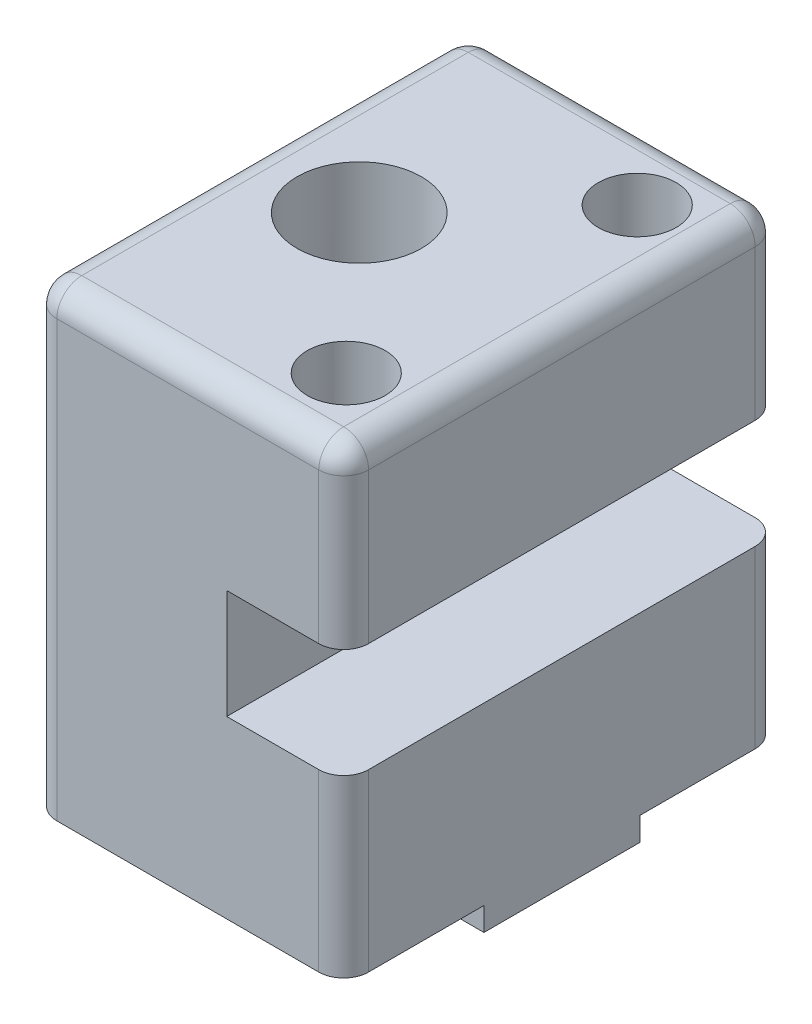
ISO-10303-21;
HEADER;
FILE_DESCRIPTION(('STEP AP214'),'2;1');
FILE_NAME('part.step','',(''),(''),'','','');
FILE_SCHEMA(('AUTOMOTIVE_DESIGN { 1 0 10303 214 1 1 1 1 }'));
ENDSEC;
DATA;
#1=APPLICATION_CONTEXT('core data for automotive mechanical design processes');
#2=APPLICATION_PROTOCOL_DEFINITION('international standard','automotive_design',2000,#1);
#3=PRODUCT_CONTEXT('',#1,'mechanical');
#4=PRODUCT('Part','Part','',(#3));
#5=PRODUCT_RELATED_PRODUCT_CATEGORY('part','',(#4));
#6=PRODUCT_DEFINITION_FORMATION('','',#4);
#7=PRODUCT_DEFINITION_CONTEXT('part definition',#1,'design');
#8=PRODUCT_DEFINITION('design','',#6,#7);
#9=PRODUCT_DEFINITION_SHAPE('','',#8);
#10=(LENGTH_UNIT() NAMED_UNIT(*) SI_UNIT(.MILLI.,.METRE.));
#11=(NAMED_UNIT(*) PLANE_ANGLE_UNIT() SI_UNIT($,.RADIAN.));
#12=(NAMED_UNIT(*) SI_UNIT($,.STERADIAN.) SOLID_ANGLE_UNIT());
#13=UNCERTAINTY_MEASURE_WITH_UNIT(LENGTH_MEASURE(1.E-05),#10,'distance_accuracy_value','');
#14=(GEOMETRIC_REPRESENTATION_CONTEXT(3) GLOBAL_UNCERTAINTY_ASSIGNED_CONTEXT((#13)) GLOBAL_UNIT_ASSIGNED_CONTEXT((#10,
#11,#12)) REPRESENTATION_CONTEXT('',''));
#15=CARTESIAN_POINT('',(0.,0.,0.));
#16=DIRECTION('',(0.,0.,1.));
#17=DIRECTION('',(1.,0.,0.));
#18=AXIS2_PLACEMENT_3D('',#15,#16,#17);
#19=CARTESIAN_POINT('',(15.875,-23.415625,22.225));
#20=DIRECTION('',(0.,1.,0.));
#21=DIRECTION('',(-1.,0.,0.));
#22=AXIS2_PLACEMENT_3D('',#19,#20,#21);
#23=PLANE('',#22);
#24=DIRECTION('',(0.,0.,-1.));
#25=VECTOR('',#24,1.);
#26=CARTESIAN_POINT('',(-15.875,-23.415625,22.225));
#27=LINE('',#26,#25);
#28=CARTESIAN_POINT('',(-15.875,-23.415625,-7.9375));
#29=VERTEX_POINT('',#28);
#30=CARTESIAN_POINT('',(-15.875,-23.415625,-19.685));
#31=VERTEX_POINT('',#30);
#32=EDGE_CURVE('E183',#29,#31,#27,.T.);
#33=ORIENTED_EDGE('',*,*,#32,.T.);
#34=CARTESIAN_POINT('',(-13.335,-23.415625,-19.685));
#35=DIRECTION('',(0.,1.,0.));
#36=DIRECTION('',(-1.,0.,0.));
#37=AXIS2_PLACEMENT_3D('',#34,#35,#36);
#38=CIRCLE('',#37,2.54);
#39=CARTESIAN_POINT('',(-13.335,-23.415625,-22.225));
#40=VERTEX_POINT('',#39);
#41=EDGE_CURVE('E294',#31,#40,#38,.F.);
#42=ORIENTED_EDGE('',*,*,#41,.T.);
#43=DIRECTION('',(1.,0.,0.));
#44=VECTOR('',#43,1.);
#45=CARTESIAN_POINT('',(15.875,-23.415625,-22.225));
#46=LINE('',#45,#44);
#47=CARTESIAN_POINT('',(13.335,-23.415625,-22.225));
#48=VERTEX_POINT('',#47);
#49=EDGE_CURVE('E216',#40,#48,#46,.T.);
#50=ORIENTED_EDGE('',*,*,#49,.T.);
#51=CARTESIAN_POINT('',(13.335,-23.415625,-19.685));
#52=DIRECTION('',(0.,1.,0.));
#53=DIRECTION('',(-1.,0.,0.));
#54=AXIS2_PLACEMENT_3D('',#51,#52,#53);
#55=CIRCLE('',#54,2.54);
#56=CARTESIAN_POINT('',(15.875,-23.415625,-19.685));
#57=VERTEX_POINT('',#56);
#58=EDGE_CURVE('E292',#48,#57,#55,.F.);
#59=ORIENTED_EDGE('',*,*,#58,.T.);
#60=DIRECTION('',(0.,0.,-1.));
#61=VECTOR('',#60,1.);
#62=CARTESIAN_POINT('',(15.875,-23.415625,22.225));
#63=LINE('',#62,#61);
#64=CARTESIAN_POINT('',(15.875,-23.415625,-7.9375));
#65=VERTEX_POINT('',#64);
#66=EDGE_CURVE('E251',#65,#57,#63,.T.);
#67=ORIENTED_EDGE('',*,*,#66,.F.);
#68=DIRECTION('',(1.,0.,0.));
#69=VECTOR('',#68,1.);
#70=CARTESIAN_POINT('',(-15.875,-23.415625,-7.9375));
#71=LINE('',#70,#69);
#72=EDGE_CURVE('E214',#29,#65,#71,.T.);
#73=ORIENTED_EDGE('',*,*,#72,.F.);
#74=EDGE_LOOP('',(#33,#42,#50,#59,#67,#73));
#75=FACE_BOUND('',#74,.T.);
#76=ADVANCED_FACE('F33',(#75),#23,.F.);
#77=CARTESIAN_POINT('',(-15.875,23.415625,22.225));
#78=DIRECTION('',(1.,0.,0.));
#79=DIRECTION('',(0.,1.,0.));
#80=AXIS2_PLACEMENT_3D('',#77,#78,#79);
#81=PLANE('',#80);
#82=DIRECTION('',(0.,0.,-1.));
#83=VECTOR('',#82,1.);
#84=CARTESIAN_POINT('',(-15.875,20.875625,22.225));
#85=LINE('',#84,#83);
#86=CARTESIAN_POINT('',(-15.875,20.875625,19.685));
#87=VERTEX_POINT('',#86);
#88=CARTESIAN_POINT('',(-15.875,20.875625,-19.685));
#89=VERTEX_POINT('',#88);
#90=EDGE_CURVE('E280',#87,#89,#85,.T.);
#91=ORIENTED_EDGE('',*,*,#90,.T.);
#92=DIRECTION('',(0.,-1.,0.));
#93=VECTOR('',#92,1.);
#94=CARTESIAN_POINT('',(-15.875,-23.415625,-19.685));
#95=LINE('',#94,#93);
#96=EDGE_CURVE('E282',#89,#31,#95,.T.);
#97=ORIENTED_EDGE('',*,*,#96,.T.);
#98=ORIENTED_EDGE('',*,*,#32,.F.);
#99=DIRECTION('',(0.,1.,0.));
#100=VECTOR('',#99,1.);
#101=CARTESIAN_POINT('',(-15.875,-23.415625,-7.9375));
#102=LINE('',#101,#100);
#103=CARTESIAN_POINT('',(-15.875,-25.796875,-7.9375));
#104=VERTEX_POINT('',#103);
#105=EDGE_CURVE('E193',#104,#29,#102,.T.);
#106=ORIENTED_EDGE('',*,*,#105,.F.);
#107=DIRECTION('',(0.,0.,-1.));
#108=VECTOR('',#107,1.);
#109=CARTESIAN_POINT('',(-15.875,-25.796875,7.9375));
#110=LINE('',#109,#108);
#111=CARTESIAN_POINT('',(-15.875,-25.796875,7.9375));
#112=VERTEX_POINT('',#111);
#113=EDGE_CURVE('E199',#112,#104,#110,.T.);
#114=ORIENTED_EDGE('',*,*,#113,.F.);
#115=DIRECTION('',(0.,-1.,0.));
#116=VECTOR('',#115,1.);
#117=CARTESIAN_POINT('',(-15.875,-23.415625,7.9375));
#118=LINE('',#117,#116);
#119=CARTESIAN_POINT('',(-15.875,-23.415625,7.9375));
#120=VERTEX_POINT('',#119);
#121=EDGE_CURVE('E189',#120,#112,#118,.T.);
#122=ORIENTED_EDGE('',*,*,#121,.F.);
#123=CARTESIAN_POINT('',(-15.875,-23.415625,19.685));
#124=VERTEX_POINT('',#123);
#125=EDGE_CURVE('E173',#124,#120,#27,.T.);
#126=ORIENTED_EDGE('',*,*,#125,.F.);
#127=DIRECTION('',(0.,-1.,0.));
#128=VECTOR('',#127,1.);
#129=CARTESIAN_POINT('',(-15.875,23.415625,19.685));
#130=LINE('',#129,#128);
#131=EDGE_CURVE('E278',#124,#87,#130,.F.);
#132=ORIENTED_EDGE('',*,*,#131,.T.);
#133=EDGE_LOOP('',(#91,#97,#98,#106,#114,#122,#126,#132));
#134=FACE_BOUND('',#133,.T.);
#135=ADVANCED_FACE('F196',(#134),#81,.F.);
#136=CARTESIAN_POINT('',(15.875,-23.415625,19.685));
#137=VERTEX_POINT('',#136);
#138=CARTESIAN_POINT('',(15.875,-23.415625,7.9375));
#139=VERTEX_POINT('',#138);
#140=EDGE_CURVE('E252',#137,#139,#63,.T.);
#141=ORIENTED_EDGE('',*,*,#140,.F.);
#142=CARTESIAN_POINT('',(13.335,-23.415625,19.685));
#143=DIRECTION('',(0.,1.,0.));
#144=DIRECTION('',(-1.,0.,0.));
#145=AXIS2_PLACEMENT_3D('',#142,#143,#144);
#146=CIRCLE('',#145,2.54);
#147=CARTESIAN_POINT('',(13.335,-23.415625,22.225));
#148=VERTEX_POINT('',#147);
#149=EDGE_CURVE('E11',#137,#148,#146,.F.);
#150=ORIENTED_EDGE('',*,*,#149,.T.);
#151=DIRECTION('',(1.,0.,0.));
#152=VECTOR('',#151,1.);
#153=CARTESIAN_POINT('',(15.875,-23.415625,22.225));
#154=LINE('',#153,#152);
#155=CARTESIAN_POINT('',(-13.335,-23.415625,22.225));
#156=VERTEX_POINT('',#155);
#157=EDGE_CURVE('E220',#156,#148,#154,.T.);
#158=ORIENTED_EDGE('',*,*,#157,.F.);
#159=CARTESIAN_POINT('',(-13.335,-23.415625,19.685));
#160=DIRECTION('',(0.,1.,0.));
#161=DIRECTION('',(-1.,0.,0.));
#162=AXIS2_PLACEMENT_3D('',#159,#160,#161);
#163=CIRCLE('',#162,2.54);
#164=EDGE_CURVE('E42',#156,#124,#163,.F.);
#165=ORIENTED_EDGE('',*,*,#164,.T.);
#166=ORIENTED_EDGE('',*,*,#125,.T.);
#167=DIRECTION('',(1.,0.,0.));
#168=VECTOR('',#167,1.);
#169=CARTESIAN_POINT('',(-15.875,-23.415625,7.9375));
#170=LINE('',#169,#168);
#171=EDGE_CURVE('E176',#120,#139,#170,.T.);
#172=ORIENTED_EDGE('',*,*,#171,.T.);
#173=EDGE_LOOP('',(#141,#150,#158,#165,#166,#172));
#174=FACE_BOUND('',#173,.T.);
#175=ADVANCED_FACE('F175',(#174),#23,.F.);
#176=CARTESIAN_POINT('',(15.875,-5.55624999999999,22.225));
#177=DIRECTION('',(-1.,0.,0.));
#178=DIRECTION('',(0.,0.,1.));
#179=AXIS2_PLACEMENT_3D('',#176,#177,#178);
#180=PLANE('',#179);
#181=ORIENTED_EDGE('',*,*,#66,.T.);
#182=DIRECTION('',(0.,1.,0.));
#183=VECTOR('',#182,1.);
#184=CARTESIAN_POINT('',(15.875,-5.55624999999999,-19.685));
#185=LINE('',#184,#183);
#186=CARTESIAN_POINT('',(15.875,-5.55624999999999,-19.685));
#187=VERTEX_POINT('',#186);
#188=EDGE_CURVE('E301',#57,#187,#185,.T.);
#189=ORIENTED_EDGE('',*,*,#188,.T.);
#190=DIRECTION('',(0.,0.,-1.));
#191=VECTOR('',#190,1.);
#192=CARTESIAN_POINT('',(15.875,-5.55624999999999,22.225));
#193=LINE('',#192,#191);
#194=CARTESIAN_POINT('',(15.875,-5.55624999999999,19.685));
#195=VERTEX_POINT('',#194);
#196=EDGE_CURVE('E248',#195,#187,#193,.T.);
#197=ORIENTED_EDGE('',*,*,#196,.F.);
#198=DIRECTION('',(0.,1.,0.));
#199=VECTOR('',#198,1.);
#200=CARTESIAN_POINT('',(15.875,-5.55624999999999,19.685));
#201=LINE('',#200,#199);
#202=EDGE_CURVE('E50',#195,#137,#201,.F.);
#203=ORIENTED_EDGE('',*,*,#202,.T.);
#204=ORIENTED_EDGE('',*,*,#140,.T.);
#205=DIRECTION('',(0.,-1.,0.));
#206=VECTOR('',#205,1.);
#207=CARTESIAN_POINT('',(15.875,-23.415625,7.9375));
#208=LINE('',#207,#206);
#209=CARTESIAN_POINT('',(15.875,-25.796875,7.9375));
#210=VERTEX_POINT('',#209);
#211=EDGE_CURVE('E191',#139,#210,#208,.T.);
#212=ORIENTED_EDGE('',*,*,#211,.T.);
#213=DIRECTION('',(0.,0.,-1.));
#214=VECTOR('',#213,1.);
#215=CARTESIAN_POINT('',(15.875,-25.796875,7.9375));
#216=LINE('',#215,#214);
#217=CARTESIAN_POINT('',(15.875,-25.796875,-7.9375));
#218=VERTEX_POINT('',#217);
#219=EDGE_CURVE('E204',#210,#218,#216,.T.);
#220=ORIENTED_EDGE('',*,*,#219,.T.);
#221=DIRECTION('',(0.,1.,0.));
#222=VECTOR('',#221,1.);
#223=CARTESIAN_POINT('',(15.875,-23.415625,-7.9375));
#224=LINE('',#223,#222);
#225=EDGE_CURVE('E200',#218,#65,#224,.T.);
#226=ORIENTED_EDGE('',*,*,#225,.T.);
#227=EDGE_LOOP('',(#181,#189,#197,#203,#204,#212,#220,#226));
#228=FACE_BOUND('',#227,.T.);
#229=ADVANCED_FACE('F427',(#228),#180,.F.);
#230=CARTESIAN_POINT('',(15.875,-5.55624999999999,22.225));
#231=DIRECTION('',(0.,-1.,0.));
#232=DIRECTION('',(1.,0.,0.));
#233=AXIS2_PLACEMENT_3D('',#230,#231,#232);
#234=PLANE('',#233);
#235=ORIENTED_EDGE('',*,*,#196,.T.);
#236=CARTESIAN_POINT('',(13.335,-5.55624999999999,-19.685));
#237=DIRECTION('',(0.,-1.,0.));
#238=DIRECTION('',(1.,0.,0.));
#239=AXIS2_PLACEMENT_3D('',#236,#237,#238);
#240=CIRCLE('',#239,2.54);
#241=CARTESIAN_POINT('',(13.335,-5.55624999999999,-22.225));
#242=VERTEX_POINT('',#241);
#243=EDGE_CURVE('E58',#187,#242,#240,.F.);
#244=ORIENTED_EDGE('',*,*,#243,.T.);
#245=DIRECTION('',(-1.,0.,0.));
#246=VECTOR('',#245,1.);
#247=CARTESIAN_POINT('',(15.875,-5.55624999999999,-22.225));
#248=LINE('',#247,#246);
#249=CARTESIAN_POINT('',(3.96875,-5.55625,-22.225));
#250=VERTEX_POINT('',#249);
#251=EDGE_CURVE('E234',#242,#250,#248,.T.);
#252=ORIENTED_EDGE('',*,*,#251,.T.);
#253=DIRECTION('',(0.,0.,-1.));
#254=VECTOR('',#253,1.);
#255=CARTESIAN_POINT('',(3.96875,-5.55625,22.225));
#256=LINE('',#255,#254);
#257=CARTESIAN_POINT('',(3.96875,-5.55625,22.225));
#258=VERTEX_POINT('',#257);
#259=EDGE_CURVE('E245',#258,#250,#256,.T.);
#260=ORIENTED_EDGE('',*,*,#259,.F.);
#261=DIRECTION('',(-1.,0.,0.));
#262=VECTOR('',#261,1.);
#263=CARTESIAN_POINT('',(15.875,-5.55624999999999,22.225));
#264=LINE('',#263,#262);
#265=CARTESIAN_POINT('',(13.335,-5.55624999999999,22.225));
#266=VERTEX_POINT('',#265);
#267=EDGE_CURVE('E223',#266,#258,#264,.T.);
#268=ORIENTED_EDGE('',*,*,#267,.F.);
#269=CARTESIAN_POINT('',(13.335,-5.55624999999999,19.685));
#270=DIRECTION('',(0.,-1.,0.));
#271=DIRECTION('',(1.,0.,0.));
#272=AXIS2_PLACEMENT_3D('',#269,#270,#271);
#273=CIRCLE('',#272,2.54);
#274=EDGE_CURVE('E303',#266,#195,#273,.F.);
#275=ORIENTED_EDGE('',*,*,#274,.T.);
#276=EDGE_LOOP('',(#235,#244,#252,#260,#268,#275));
#277=FACE_BOUND('',#276,.T.);
#278=ADVANCED_FACE('F431',(#277),#234,.F.);
#279=CARTESIAN_POINT('',(3.96874999999999,5.55625,22.225));
#280=DIRECTION('',(-1.,0.,0.));
#281=DIRECTION('',(0.,-1.,0.));
#282=AXIS2_PLACEMENT_3D('',#279,#280,#281);
#283=PLANE('',#282);
#284=DIRECTION('',(0.,1.,0.));
#285=VECTOR('',#284,1.);
#286=CARTESIAN_POINT('',(3.96874999999999,5.55625,-22.225));
#287=LINE('',#286,#285);
#288=CARTESIAN_POINT('',(3.96874999999999,5.55625,-22.225));
#289=VERTEX_POINT('',#288);
#290=EDGE_CURVE('E236',#250,#289,#287,.T.);
#291=ORIENTED_EDGE('',*,*,#290,.T.);
#292=DIRECTION('',(0.,0.,-1.));
#293=VECTOR('',#292,1.);
#294=CARTESIAN_POINT('',(3.96874999999999,5.55625,22.225));
#295=LINE('',#294,#293);
#296=CARTESIAN_POINT('',(3.96874999999999,5.55625,22.225));
#297=VERTEX_POINT('',#296);
#298=EDGE_CURVE('E242',#297,#289,#295,.T.);
#299=ORIENTED_EDGE('',*,*,#298,.F.);
#300=DIRECTION('',(0.,1.,0.));
#301=VECTOR('',#300,1.);
#302=CARTESIAN_POINT('',(3.96874999999999,5.55625,22.225));
#303=LINE('',#302,#301);
#304=EDGE_CURVE('E226',#258,#297,#303,.T.);
#305=ORIENTED_EDGE('',*,*,#304,.F.);
#306=ORIENTED_EDGE('',*,*,#259,.T.);
#307=EDGE_LOOP('',(#291,#299,#305,#306));
#308=FACE_BOUND('',#307,.T.);
#309=ADVANCED_FACE('F370',(#308),#283,.F.);
#310=CARTESIAN_POINT('',(15.875,5.55625,22.225));
#311=DIRECTION('',(0.,1.,0.));
#312=DIRECTION('',(0.,0.,1.));
#313=AXIS2_PLACEMENT_3D('',#310,#311,#312);
#314=PLANE('',#313);
#315=CARTESIAN_POINT('',(8.73125,5.55625,-14.8166666666667));
#316=DIRECTION('',(0.,1.,0.));
#317=DIRECTION('',(0.,0.,1.));
#318=AXIS2_PLACEMENT_3D('',#315,#316,#317);
#319=CIRCLE('',#318,3.96875);
#320=CARTESIAN_POINT('',(8.73125,5.55625,-10.8479166666667));
#321=VERTEX_POINT('',#320);
#322=EDGE_CURVE('E348',#321,#321,#319,.F.);
#323=ORIENTED_EDGE('',*,*,#322,.F.);
#324=EDGE_LOOP('',(#323));
#325=FACE_BOUND('',#324,.T.);
#326=CARTESIAN_POINT('',(8.73125,5.55625,14.8166666666667));
#327=DIRECTION('',(0.,1.,0.));
#328=DIRECTION('',(0.,0.,1.));
#329=AXIS2_PLACEMENT_3D('',#326,#327,#328);
#330=CIRCLE('',#329,3.96875);
#331=CARTESIAN_POINT('',(8.73125,5.55625,18.7854166666667));
#332=VERTEX_POINT('',#331);
#333=EDGE_CURVE('E340',#332,#332,#330,.F.);
#334=ORIENTED_EDGE('',*,*,#333,.F.);
#335=EDGE_LOOP('',(#334));
#336=FACE_BOUND('',#335,.T.);
#337=DIRECTION('',(1.,0.,0.));
#338=VECTOR('',#337,1.);
#339=CARTESIAN_POINT('',(15.875,5.55625,-22.225));
#340=LINE('',#339,#338);
#341=CARTESIAN_POINT('',(13.335,5.55625,-22.225));
#342=VERTEX_POINT('',#341);
#343=EDGE_CURVE('E224',#289,#342,#340,.T.);
#344=ORIENTED_EDGE('',*,*,#343,.T.);
#345=CARTESIAN_POINT('',(13.335,5.55625,-19.685));
#346=DIRECTION('',(0.,1.,0.));
#347=DIRECTION('',(0.,0.,1.));
#348=AXIS2_PLACEMENT_3D('',#345,#346,#347);
#349=CIRCLE('',#348,2.54);
#350=CARTESIAN_POINT('',(15.875,5.55625,-19.685));
#351=VERTEX_POINT('',#350);
#352=EDGE_CURVE('E298',#342,#351,#349,.F.);
#353=ORIENTED_EDGE('',*,*,#352,.T.);
#354=DIRECTION('',(0.,0.,-1.));
#355=VECTOR('',#354,1.);
#356=CARTESIAN_POINT('',(15.875,5.55625,22.225));
#357=LINE('',#356,#355);
#358=CARTESIAN_POINT('',(15.875,5.55625,19.685));
#359=VERTEX_POINT('',#358);
#360=EDGE_CURVE('E231',#359,#351,#357,.T.);
#361=ORIENTED_EDGE('',*,*,#360,.F.);
#362=CARTESIAN_POINT('',(13.335,5.55625,19.685));
#363=DIRECTION('',(0.,1.,0.));
#364=DIRECTION('',(0.,0.,1.));
#365=AXIS2_PLACEMENT_3D('',#362,#363,#364);
#366=CIRCLE('',#365,2.54);
#367=CARTESIAN_POINT('',(13.335,5.55625,22.225));
#368=VERTEX_POINT('',#367);
#369=EDGE_CURVE('E296',#359,#368,#366,.F.);
#370=ORIENTED_EDGE('',*,*,#369,.T.);
#371=DIRECTION('',(1.,0.,0.));
#372=VECTOR('',#371,1.);
#373=CARTESIAN_POINT('',(15.875,5.55625,22.225));
#374=LINE('',#373,#372);
#375=EDGE_CURVE('E228',#297,#368,#374,.T.);
#376=ORIENTED_EDGE('',*,*,#375,.F.);
#377=ORIENTED_EDGE('',*,*,#298,.T.);
#378=EDGE_LOOP('',(#344,#353,#361,#370,#376,#377));
#379=FACE_BOUND('',#378,.T.);
#380=ADVANCED_FACE('F366',(#325,#336,#379),#314,.F.);
#381=CARTESIAN_POINT('',(15.875,23.415625,22.225));
#382=DIRECTION('',(-1.,0.,0.));
#383=DIRECTION('',(0.,-1.,0.));
#384=AXIS2_PLACEMENT_3D('',#381,#382,#383);
#385=PLANE('',#384);
#386=ORIENTED_EDGE('',*,*,#360,.T.);
#387=DIRECTION('',(0.,1.,0.));
#388=VECTOR('',#387,1.);
#389=CARTESIAN_POINT('',(15.875,23.415625,-19.685));
#390=LINE('',#389,#388);
#391=CARTESIAN_POINT('',(15.875,20.875625,-19.685));
#392=VERTEX_POINT('',#391);
#393=EDGE_CURVE('E267',#351,#392,#390,.T.);
#394=ORIENTED_EDGE('',*,*,#393,.T.);
#395=DIRECTION('',(0.,0.,-1.));
#396=VECTOR('',#395,1.);
#397=CARTESIAN_POINT('',(15.875,20.875625,22.225));
#398=LINE('',#397,#396);
#399=CARTESIAN_POINT('',(15.875,20.875625,19.685));
#400=VERTEX_POINT('',#399);
#401=EDGE_CURVE('E264',#392,#400,#398,.F.);
#402=ORIENTED_EDGE('',*,*,#401,.T.);
#403=DIRECTION('',(0.,1.,0.));
#404=VECTOR('',#403,1.);
#405=CARTESIAN_POINT('',(15.875,23.415625,19.685));
#406=LINE('',#405,#404);
#407=EDGE_CURVE('E262',#400,#359,#406,.F.);
#408=ORIENTED_EDGE('',*,*,#407,.T.);
#409=EDGE_LOOP('',(#386,#394,#402,#408));
#410=FACE_BOUND('',#409,.T.);
#411=ADVANCED_FACE('F369',(#410),#385,.F.);
#412=CARTESIAN_POINT('',(15.875,23.415625,22.225));
#413=DIRECTION('',(0.,-1.,0.));
#414=DIRECTION('',(1.,0.,0.));
#415=AXIS2_PLACEMENT_3D('',#412,#413,#414);
#416=PLANE('',#415);
#417=DIRECTION('',(-1.,0.,0.));
#418=VECTOR('',#417,1.);
#419=CARTESIAN_POINT('',(15.875,23.415625,19.685));
#420=LINE('',#419,#418);
#421=CARTESIAN_POINT('',(-13.335,23.415625,19.685));
#422=VERTEX_POINT('',#421);
#423=CARTESIAN_POINT('',(13.335,23.415625,19.685));
#424=VERTEX_POINT('',#423);
#425=EDGE_CURVE('E257',#422,#424,#420,.F.);
#426=ORIENTED_EDGE('',*,*,#425,.T.);
#427=DIRECTION('',(0.,0.,-1.));
#428=VECTOR('',#427,1.);
#429=CARTESIAN_POINT('',(13.335,23.415625,22.225));
#430=LINE('',#429,#428);
#431=CARTESIAN_POINT('',(13.335,23.415625,-19.685));
#432=VERTEX_POINT('',#431);
#433=EDGE_CURVE('E259',#424,#432,#430,.T.);
#434=ORIENTED_EDGE('',*,*,#433,.T.);
#435=DIRECTION('',(-1.,0.,0.));
#436=VECTOR('',#435,1.);
#437=CARTESIAN_POINT('',(-15.875,23.415625,-19.685));
#438=LINE('',#437,#436);
#439=CARTESIAN_POINT('',(-13.335,23.415625,-19.685));
#440=VERTEX_POINT('',#439);
#441=EDGE_CURVE('E182',#432,#440,#438,.T.);
#442=ORIENTED_EDGE('',*,*,#441,.T.);
#443=DIRECTION('',(0.,0.,-1.));
#444=VECTOR('',#443,1.);
#445=CARTESIAN_POINT('',(-13.335,23.415625,22.225));
#446=LINE('',#445,#444);
#447=EDGE_CURVE('E255',#440,#422,#446,.F.);
#448=ORIENTED_EDGE('',*,*,#447,.T.);
#449=EDGE_LOOP('',(#426,#434,#442,#448));
#450=FACE_BOUND('',#449,.T.);
#451=CARTESIAN_POINT('',(8.73124999999999,23.415625,-14.8166666666667));
#452=DIRECTION('',(0.,1.,0.));
#453=DIRECTION('',(-1.,0.,0.));
#454=AXIS2_PLACEMENT_3D('',#451,#452,#453);
#455=CIRCLE('',#454,3.96875);
#456=CARTESIAN_POINT('',(4.76249999999999,23.415625,-14.8166666666667));
#457=VERTEX_POINT('',#456);
#458=EDGE_CURVE('E351',#457,#457,#455,.T.);
#459=ORIENTED_EDGE('',*,*,#458,.F.);
#460=EDGE_LOOP('',(#459));
#461=FACE_BOUND('',#460,.T.);
#462=CARTESIAN_POINT('',(8.73124999999999,23.415625,14.8166666666667));
#463=DIRECTION('',(0.,1.,0.));
#464=DIRECTION('',(1.,0.,0.));
#465=AXIS2_PLACEMENT_3D('',#462,#463,#464);
#466=CIRCLE('',#465,3.96875);
#467=CARTESIAN_POINT('',(12.7,23.415625,14.8166666666667));
#468=VERTEX_POINT('',#467);
#469=EDGE_CURVE('E343',#468,#468,#466,.T.);
#470=ORIENTED_EDGE('',*,*,#469,.F.);
#471=EDGE_LOOP('',(#470));
#472=FACE_BOUND('',#471,.T.);
#473=CARTESIAN_POINT('',(-4.76250000000001,23.415625,0.));
#474=DIRECTION('',(0.,-1.,0.));
#475=DIRECTION('',(1.,0.,0.));
#476=AXIS2_PLACEMENT_3D('',#473,#474,#475);
#477=CIRCLE('',#476,6.33095);
#478=CARTESIAN_POINT('',(1.56845,23.415625,0.));
#479=VERTEX_POINT('',#478);
#480=EDGE_CURVE('E207',#479,#479,#477,.T.);
#481=ORIENTED_EDGE('',*,*,#480,.T.);
#482=EDGE_LOOP('',(#481));
#483=FACE_BOUND('',#482,.T.);
#484=ADVANCED_FACE('F444',(#450,#461,#472,#483),#416,.F.);
#485=CARTESIAN_POINT('',(0.,0.,22.225));
#486=DIRECTION('',(0.,0.,-1.));
#487=DIRECTION('',(-1.,0.,0.));
#488=AXIS2_PLACEMENT_3D('',#485,#486,#487);
#489=PLANE('',#488);
#490=ORIENTED_EDGE('',*,*,#157,.T.);
#491=DIRECTION('',(0.,1.,0.));
#492=VECTOR('',#491,1.);
#493=CARTESIAN_POINT('',(13.335,0.,22.225));
#494=LINE('',#493,#492);
#495=EDGE_CURVE('E275',#148,#266,#494,.T.);
#496=ORIENTED_EDGE('',*,*,#495,.T.);
#497=ORIENTED_EDGE('',*,*,#267,.T.);
#498=ORIENTED_EDGE('',*,*,#304,.T.);
#499=ORIENTED_EDGE('',*,*,#375,.T.);
#500=DIRECTION('',(0.,1.,0.));
#501=VECTOR('',#500,1.);
#502=CARTESIAN_POINT('',(13.335,0.,22.225));
#503=LINE('',#502,#501);
#504=CARTESIAN_POINT('',(13.335,20.875625,22.225));
#505=VERTEX_POINT('',#504);
#506=EDGE_CURVE('E273',#368,#505,#503,.T.);
#507=ORIENTED_EDGE('',*,*,#506,.T.);
#508=DIRECTION('',(-1.,0.,0.));
#509=VECTOR('',#508,1.);
#510=CARTESIAN_POINT('',(0.,20.875625,22.225));
#511=LINE('',#510,#509);
#512=CARTESIAN_POINT('',(-13.335,20.875625,22.225));
#513=VERTEX_POINT('',#512);
#514=EDGE_CURVE('E271',#505,#513,#511,.T.);
#515=ORIENTED_EDGE('',*,*,#514,.T.);
#516=DIRECTION('',(0.,-1.,0.));
#517=VECTOR('',#516,1.);
#518=CARTESIAN_POINT('',(-13.335,0.,22.225));
#519=LINE('',#518,#517);
#520=EDGE_CURVE('E269',#513,#156,#519,.T.);
#521=ORIENTED_EDGE('',*,*,#520,.T.);
#522=EDGE_LOOP('',(#490,#496,#497,#498,#499,#507,#515,#521));
#523=FACE_BOUND('',#522,.T.);
#524=ADVANCED_FACE('F396',(#523),#489,.F.);
#525=CARTESIAN_POINT('',(0.,0.,-22.225));
#526=DIRECTION('',(0.,0.,-1.));
#527=DIRECTION('',(-1.,0.,0.));
#528=AXIS2_PLACEMENT_3D('',#525,#526,#527);
#529=PLANE('',#528);
#530=ORIENTED_EDGE('',*,*,#49,.F.);
#531=DIRECTION('',(0.,-1.,0.));
#532=VECTOR('',#531,1.);
#533=CARTESIAN_POINT('',(-13.335,23.415625,-22.225));
#534=LINE('',#533,#532);
#535=CARTESIAN_POINT('',(-13.335,20.875625,-22.225));
#536=VERTEX_POINT('',#535);
#537=EDGE_CURVE('E290',#40,#536,#534,.F.);
#538=ORIENTED_EDGE('',*,*,#537,.T.);
#539=DIRECTION('',(-1.,0.,0.));
#540=VECTOR('',#539,1.);
#541=CARTESIAN_POINT('',(15.875,20.875625,-22.225));
#542=LINE('',#541,#540);
#543=CARTESIAN_POINT('',(13.335,20.875625,-22.225));
#544=VERTEX_POINT('',#543);
#545=EDGE_CURVE('E288',#536,#544,#542,.F.);
#546=ORIENTED_EDGE('',*,*,#545,.T.);
#547=DIRECTION('',(0.,1.,0.));
#548=VECTOR('',#547,1.);
#549=CARTESIAN_POINT('',(13.335,5.55625,-22.225));
#550=LINE('',#549,#548);
#551=EDGE_CURVE('E286',#544,#342,#550,.F.);
#552=ORIENTED_EDGE('',*,*,#551,.T.);
#553=ORIENTED_EDGE('',*,*,#343,.F.);
#554=ORIENTED_EDGE('',*,*,#290,.F.);
#555=ORIENTED_EDGE('',*,*,#251,.F.);
#556=DIRECTION('',(0.,1.,0.));
#557=VECTOR('',#556,1.);
#558=CARTESIAN_POINT('',(13.335,-23.415625,-22.225));
#559=LINE('',#558,#557);
#560=EDGE_CURVE('E284',#242,#48,#559,.F.);
#561=ORIENTED_EDGE('',*,*,#560,.T.);
#562=EDGE_LOOP('',(#530,#538,#546,#552,#553,#554,#555,#561));
#563=FACE_BOUND('',#562,.T.);
#564=ADVANCED_FACE('F448',(#563),#529,.T.);
#565=CARTESIAN_POINT('',(-15.875,-23.415625,-7.9375));
#566=DIRECTION('',(0.,0.,-1.));
#567=DIRECTION('',(-1.,0.,0.));
#568=AXIS2_PLACEMENT_3D('',#565,#566,#567);
#569=PLANE('',#568);
#570=ORIENTED_EDGE('',*,*,#225,.F.);
#571=DIRECTION('',(1.,0.,0.));
#572=VECTOR('',#571,1.);
#573=CARTESIAN_POINT('',(-15.875,-25.796875,-7.9375));
#574=LINE('',#573,#572);
#575=EDGE_CURVE('E217',#104,#218,#574,.T.);
#576=ORIENTED_EDGE('',*,*,#575,.F.);
#577=ORIENTED_EDGE('',*,*,#105,.T.);
#578=ORIENTED_EDGE('',*,*,#72,.T.);
#579=EDGE_LOOP('',(#570,#576,#577,#578));
#580=FACE_BOUND('',#579,.T.);
#581=ADVANCED_FACE('F451',(#580),#569,.T.);
#582=CARTESIAN_POINT('',(-15.875,-25.796875,7.9375));
#583=DIRECTION('',(0.,-1.,0.));
#584=DIRECTION('',(0.,0.,-1.));
#585=AXIS2_PLACEMENT_3D('',#582,#583,#584);
#586=PLANE('',#585);
#587=CARTESIAN_POINT('',(-4.7625,-25.796875,0.));
#588=DIRECTION('',(0.,1.,0.));
#589=DIRECTION('',(-1.,0.,0.));
#590=AXIS2_PLACEMENT_3D('',#587,#588,#589);
#591=CIRCLE('',#590,6.33095);
#592=CARTESIAN_POINT('',(-11.09345,-25.796875,0.));
#593=VERTEX_POINT('',#592);
#594=EDGE_CURVE('E353',#593,#593,#591,.T.);
#595=ORIENTED_EDGE('',*,*,#594,.T.);
#596=EDGE_LOOP('',(#595));
#597=FACE_BOUND('',#596,.T.);
#598=ORIENTED_EDGE('',*,*,#219,.F.);
#599=DIRECTION('',(1.,0.,0.));
#600=VECTOR('',#599,1.);
#601=CARTESIAN_POINT('',(-15.875,-25.796875,7.9375));
#602=LINE('',#601,#600);
#603=EDGE_CURVE('E192',#112,#210,#602,.T.);
#604=ORIENTED_EDGE('',*,*,#603,.F.);
#605=ORIENTED_EDGE('',*,*,#113,.T.);
#606=ORIENTED_EDGE('',*,*,#575,.T.);
#607=EDGE_LOOP('',(#598,#604,#605,#606));
#608=FACE_BOUND('',#607,.T.);
#609=ADVANCED_FACE('F457',(#597,#608),#586,.T.);
#610=CARTESIAN_POINT('',(-15.875,-23.415625,7.9375));
#611=DIRECTION('',(0.,0.,1.));
#612=DIRECTION('',(1.,0.,0.));
#613=AXIS2_PLACEMENT_3D('',#610,#611,#612);
#614=PLANE('',#613);
#615=ORIENTED_EDGE('',*,*,#211,.F.);
#616=ORIENTED_EDGE('',*,*,#171,.F.);
#617=ORIENTED_EDGE('',*,*,#121,.T.);
#618=ORIENTED_EDGE('',*,*,#603,.T.);
#619=EDGE_LOOP('',(#615,#616,#617,#618));
#620=FACE_BOUND('',#619,.T.);
#621=ADVANCED_FACE('F188',(#620),#614,.T.);
#622=CARTESIAN_POINT('',(-4.7625,-25.796875,0.));
#623=DIRECTION('',(0.,1.,0.));
#624=DIRECTION('',(-1.,0.,0.));
#625=AXIS2_PLACEMENT_3D('',#622,#623,#624);
#626=CYLINDRICAL_SURFACE('',#625,6.33095);
#627=ORIENTED_EDGE('',*,*,#594,.F.);
#628=EDGE_LOOP('',(#627));
#629=FACE_BOUND('',#628,.T.);
#630=ORIENTED_EDGE('',*,*,#480,.F.);
#631=EDGE_LOOP('',(#630));
#632=FACE_BOUND('',#631,.T.);
#633=ADVANCED_FACE('F456',(#629,#632),#626,.F.);
#634=CARTESIAN_POINT('',(8.73125,-25.797875,14.8166666666667));
#635=DIRECTION('',(0.,1.,0.));
#636=DIRECTION('',(-1.,0.,0.));
#637=AXIS2_PLACEMENT_3D('',#634,#635,#636);
#638=CYLINDRICAL_SURFACE('',#637,3.96875);
#639=ORIENTED_EDGE('',*,*,#469,.T.);
#640=EDGE_LOOP('',(#639));
#641=FACE_BOUND('',#640,.T.);
#642=ORIENTED_EDGE('',*,*,#333,.T.);
#643=EDGE_LOOP('',(#642));
#644=FACE_BOUND('',#643,.T.);
#645=ADVANCED_FACE('F465',(#641,#644),#638,.F.);
#646=CARTESIAN_POINT('',(8.73125,-25.797875,-14.8166666666667));
#647=DIRECTION('',(0.,1.,0.));
#648=DIRECTION('',(-1.,0.,0.));
#649=AXIS2_PLACEMENT_3D('',#646,#647,#648);
#650=CYLINDRICAL_SURFACE('',#649,3.96875);
#651=ORIENTED_EDGE('',*,*,#458,.T.);
#652=EDGE_LOOP('',(#651));
#653=FACE_BOUND('',#652,.T.);
#654=ORIENTED_EDGE('',*,*,#322,.T.);
#655=EDGE_LOOP('',(#654));
#656=FACE_BOUND('',#655,.T.);
#657=ADVANCED_FACE('F364',(#653,#656),#650,.F.);
#658=CARTESIAN_POINT('',(-13.335,0.,19.685));
#659=DIRECTION('',(0.,-1.,0.));
#660=DIRECTION('',(1.,0.,0.));
#661=AXIS2_PLACEMENT_3D('',#658,#659,#660);
#662=CYLINDRICAL_SURFACE('',#661,2.54);
#663=ORIENTED_EDGE('',*,*,#164,.F.);
#664=ORIENTED_EDGE('',*,*,#520,.F.);
#665=CARTESIAN_POINT('',(-13.335,20.875625,19.685));
#666=DIRECTION('',(0.,1.,0.));
#667=DIRECTION('',(0.,0.,1.));
#668=AXIS2_PLACEMENT_3D('',#665,#666,#667);
#669=CIRCLE('',#668,2.54);
#670=EDGE_CURVE('E37',#87,#513,#669,.T.);
#671=ORIENTED_EDGE('',*,*,#670,.F.);
#672=ORIENTED_EDGE('',*,*,#131,.F.);
#673=EDGE_LOOP('',(#663,#664,#671,#672));
#674=FACE_BOUND('',#673,.T.);
#675=ADVANCED_FACE('F471',(#674),#662,.T.);
#676=CARTESIAN_POINT('',(-13.335,20.875625,22.225));
#677=DIRECTION('',(0.,0.,-1.));
#678=DIRECTION('',(-1.,0.,0.));
#679=AXIS2_PLACEMENT_3D('',#676,#677,#678);
#680=CYLINDRICAL_SURFACE('',#679,2.54);
#681=CARTESIAN_POINT('',(-13.335,20.875625,-19.685));
#682=DIRECTION('',(0.,0.,-1.));
#683=DIRECTION('',(-1.,0.,0.));
#684=AXIS2_PLACEMENT_3D('',#681,#682,#683);
#685=CIRCLE('',#684,2.54);
#686=EDGE_CURVE('E332',#89,#440,#685,.T.);
#687=ORIENTED_EDGE('',*,*,#686,.F.);
#688=ORIENTED_EDGE('',*,*,#90,.F.);
#689=CARTESIAN_POINT('',(-13.335,20.875625,19.685));
#690=DIRECTION('',(0.,0.,1.));
#691=DIRECTION('',(1.,0.,0.));
#692=AXIS2_PLACEMENT_3D('',#689,#690,#691);
#693=CIRCLE('',#692,2.54);
#694=EDGE_CURVE('E334',#422,#87,#693,.T.);
#695=ORIENTED_EDGE('',*,*,#694,.F.);
#696=ORIENTED_EDGE('',*,*,#447,.F.);
#697=EDGE_LOOP('',(#687,#688,#695,#696));
#698=FACE_BOUND('',#697,.T.);
#699=ADVANCED_FACE('F414',(#698),#680,.T.);
#700=CARTESIAN_POINT('',(-13.335,23.415625,-19.685));
#701=DIRECTION('',(0.,1.,0.));
#702=DIRECTION('',(-1.,0.,0.));
#703=AXIS2_PLACEMENT_3D('',#700,#701,#702);
#704=CYLINDRICAL_SURFACE('',#703,2.54);
#705=ORIENTED_EDGE('',*,*,#41,.F.);
#706=ORIENTED_EDGE('',*,*,#96,.F.);
#707=CARTESIAN_POINT('',(-13.335,20.875625,-19.685));
#708=DIRECTION('',(0.,1.,0.));
#709=DIRECTION('',(0.,0.,1.));
#710=AXIS2_PLACEMENT_3D('',#707,#708,#709);
#711=CIRCLE('',#710,2.54);
#712=EDGE_CURVE('E329',#536,#89,#711,.T.);
#713=ORIENTED_EDGE('',*,*,#712,.F.);
#714=ORIENTED_EDGE('',*,*,#537,.F.);
#715=EDGE_LOOP('',(#705,#706,#713,#714));
#716=FACE_BOUND('',#715,.T.);
#717=ADVANCED_FACE('F406',(#716),#704,.T.);
#718=CARTESIAN_POINT('',(-13.335,20.875625,19.685));
#719=DIRECTION('',(0.,0.,1.));
#720=DIRECTION('',(1.,0.,0.));
#721=AXIS2_PLACEMENT_3D('',#718,#719,#720);
#722=SPHERICAL_SURFACE('',#721,2.54);
#723=ORIENTED_EDGE('',*,*,#694,.T.);
#724=ORIENTED_EDGE('',*,*,#670,.T.);
#725=CARTESIAN_POINT('',(-13.335,20.875625,19.685));
#726=DIRECTION('',(-1.,0.,0.));
#727=DIRECTION('',(0.,0.,1.));
#728=AXIS2_PLACEMENT_3D('',#725,#726,#727);
#729=CIRCLE('',#728,2.54);
#730=EDGE_CURVE('E326',#422,#513,#729,.F.);
#731=ORIENTED_EDGE('',*,*,#730,.F.);
#732=EDGE_LOOP('',(#723,#724,#731));
#733=FACE_BOUND('',#732,.T.);
#734=ADVANCED_FACE('F403',(#733),#722,.T.);
#735=CARTESIAN_POINT('',(-13.335,20.875625,-19.685));
#736=DIRECTION('',(0.,0.,1.));
#737=DIRECTION('',(1.,0.,0.));
#738=AXIS2_PLACEMENT_3D('',#735,#736,#737);
#739=SPHERICAL_SURFACE('',#738,2.54);
#740=ORIENTED_EDGE('',*,*,#712,.T.);
#741=ORIENTED_EDGE('',*,*,#686,.T.);
#742=CARTESIAN_POINT('',(-13.335,20.875625,-19.685));
#743=DIRECTION('',(-1.,0.,0.));
#744=DIRECTION('',(0.,0.,1.));
#745=AXIS2_PLACEMENT_3D('',#742,#743,#744);
#746=CIRCLE('',#745,2.54);
#747=EDGE_CURVE('E323',#536,#440,#746,.F.);
#748=ORIENTED_EDGE('',*,*,#747,.F.);
#749=EDGE_LOOP('',(#740,#741,#748));
#750=FACE_BOUND('',#749,.T.);
#751=ADVANCED_FACE('F405',(#750),#739,.T.);
#752=CARTESIAN_POINT('',(13.335,0.,19.685));
#753=DIRECTION('',(0.,1.,0.));
#754=DIRECTION('',(-1.,0.,0.));
#755=AXIS2_PLACEMENT_3D('',#752,#753,#754);
#756=CYLINDRICAL_SURFACE('',#755,2.54);
#757=ORIENTED_EDGE('',*,*,#369,.F.);
#758=ORIENTED_EDGE('',*,*,#407,.F.);
#759=CARTESIAN_POINT('',(13.335,20.875625,19.685));
#760=DIRECTION('',(0.,1.,0.));
#761=DIRECTION('',(0.,0.,1.));
#762=AXIS2_PLACEMENT_3D('',#759,#760,#761);
#763=CIRCLE('',#762,2.54);
#764=EDGE_CURVE('E320',#505,#400,#763,.T.);
#765=ORIENTED_EDGE('',*,*,#764,.F.);
#766=ORIENTED_EDGE('',*,*,#506,.F.);
#767=EDGE_LOOP('',(#757,#758,#765,#766));
#768=FACE_BOUND('',#767,.T.);
#769=ADVANCED_FACE('F392',(#768),#756,.T.);
#770=CARTESIAN_POINT('',(0.,20.875625,19.685));
#771=DIRECTION('',(-1.,0.,0.));
#772=DIRECTION('',(0.,-1.,0.));
#773=AXIS2_PLACEMENT_3D('',#770,#771,#772);
#774=CYLINDRICAL_SURFACE('',#773,2.54);
#775=ORIENTED_EDGE('',*,*,#730,.T.);
#776=ORIENTED_EDGE('',*,*,#514,.F.);
#777=CARTESIAN_POINT('',(13.335,20.875625,19.685));
#778=DIRECTION('',(1.,0.,0.));
#779=DIRECTION('',(0.,0.,-1.));
#780=AXIS2_PLACEMENT_3D('',#777,#778,#779);
#781=CIRCLE('',#780,2.54);
#782=EDGE_CURVE('E317',#424,#505,#781,.T.);
#783=ORIENTED_EDGE('',*,*,#782,.F.);
#784=ORIENTED_EDGE('',*,*,#425,.F.);
#785=EDGE_LOOP('',(#775,#776,#783,#784));
#786=FACE_BOUND('',#785,.T.);
#787=ADVANCED_FACE('F400',(#786),#774,.T.);
#788=CARTESIAN_POINT('',(15.875,20.875625,-19.685));
#789=DIRECTION('',(1.,0.,0.));
#790=DIRECTION('',(0.,1.,0.));
#791=AXIS2_PLACEMENT_3D('',#788,#789,#790);
#792=CYLINDRICAL_SURFACE('',#791,2.54);
#793=ORIENTED_EDGE('',*,*,#747,.T.);
#794=ORIENTED_EDGE('',*,*,#441,.F.);
#795=CARTESIAN_POINT('',(13.335,20.875625,-19.685));
#796=DIRECTION('',(1.,0.,0.));
#797=DIRECTION('',(0.,0.,-1.));
#798=AXIS2_PLACEMENT_3D('',#795,#796,#797);
#799=CIRCLE('',#798,2.54);
#800=EDGE_CURVE('E314',#544,#432,#799,.T.);
#801=ORIENTED_EDGE('',*,*,#800,.F.);
#802=ORIENTED_EDGE('',*,*,#545,.F.);
#803=EDGE_LOOP('',(#793,#794,#801,#802));
#804=FACE_BOUND('',#803,.T.);
#805=ADVANCED_FACE('F511',(#804),#792,.T.);
#806=CARTESIAN_POINT('',(13.335,23.415625,-19.685));
#807=DIRECTION('',(0.,-1.,0.));
#808=DIRECTION('',(1.,0.,0.));
#809=AXIS2_PLACEMENT_3D('',#806,#807,#808);
#810=CYLINDRICAL_SURFACE('',#809,2.54);
#811=ORIENTED_EDGE('',*,*,#352,.F.);
#812=ORIENTED_EDGE('',*,*,#551,.F.);
#813=CARTESIAN_POINT('',(13.335,20.875625,-19.685));
#814=DIRECTION('',(0.,1.,0.));
#815=DIRECTION('',(0.,0.,1.));
#816=AXIS2_PLACEMENT_3D('',#813,#814,#815);
#817=CIRCLE('',#816,2.54);
#818=EDGE_CURVE('E311',#392,#544,#817,.T.);
#819=ORIENTED_EDGE('',*,*,#818,.F.);
#820=ORIENTED_EDGE('',*,*,#393,.F.);
#821=EDGE_LOOP('',(#811,#812,#819,#820));
#822=FACE_BOUND('',#821,.T.);
#823=ADVANCED_FACE('F383',(#822),#810,.T.);
#824=CARTESIAN_POINT('',(13.335,20.875625,19.685));
#825=DIRECTION('',(0.,0.,1.));
#826=DIRECTION('',(1.,0.,0.));
#827=AXIS2_PLACEMENT_3D('',#824,#825,#826);
#828=SPHERICAL_SURFACE('',#827,2.54);
#829=ORIENTED_EDGE('',*,*,#782,.T.);
#830=ORIENTED_EDGE('',*,*,#764,.T.);
#831=CARTESIAN_POINT('',(13.335,20.875625,19.685));
#832=DIRECTION('',(0.,0.,1.));
#833=DIRECTION('',(1.,0.,0.));
#834=AXIS2_PLACEMENT_3D('',#831,#832,#833);
#835=CIRCLE('',#834,2.54);
#836=EDGE_CURVE('E309',#424,#400,#835,.F.);
#837=ORIENTED_EDGE('',*,*,#836,.F.);
#838=EDGE_LOOP('',(#829,#830,#837));
#839=FACE_BOUND('',#838,.T.);
#840=ADVANCED_FACE('F522',(#839),#828,.T.);
#841=CARTESIAN_POINT('',(13.335,20.875625,-19.685));
#842=DIRECTION('',(0.,0.,1.));
#843=DIRECTION('',(1.,0.,0.));
#844=AXIS2_PLACEMENT_3D('',#841,#842,#843);
#845=SPHERICAL_SURFACE('',#844,2.54);
#846=ORIENTED_EDGE('',*,*,#818,.T.);
#847=ORIENTED_EDGE('',*,*,#800,.T.);
#848=CARTESIAN_POINT('',(13.335,20.875625,-19.685));
#849=DIRECTION('',(0.,0.,-1.));
#850=DIRECTION('',(-1.,0.,0.));
#851=AXIS2_PLACEMENT_3D('',#848,#849,#850);
#852=CIRCLE('',#851,2.54);
#853=EDGE_CURVE('E307',#392,#432,#852,.F.);
#854=ORIENTED_EDGE('',*,*,#853,.F.);
#855=EDGE_LOOP('',(#846,#847,#854));
#856=FACE_BOUND('',#855,.T.);
#857=ADVANCED_FACE('F490',(#856),#845,.T.);
#858=CARTESIAN_POINT('',(13.335,20.875625,22.225));
#859=DIRECTION('',(0.,0.,-1.));
#860=DIRECTION('',(-1.,0.,0.));
#861=AXIS2_PLACEMENT_3D('',#858,#859,#860);
#862=CYLINDRICAL_SURFACE('',#861,2.54);
#863=ORIENTED_EDGE('',*,*,#836,.T.);
#864=ORIENTED_EDGE('',*,*,#401,.F.);
#865=ORIENTED_EDGE('',*,*,#853,.T.);
#866=ORIENTED_EDGE('',*,*,#433,.F.);
#867=EDGE_LOOP('',(#863,#864,#865,#866));
#868=FACE_BOUND('',#867,.T.);
#869=ADVANCED_FACE('F484',(#868),#862,.T.);
#870=CARTESIAN_POINT('',(13.335,-5.55624999999999,-19.685));
#871=DIRECTION('',(0.,-1.,0.));
#872=DIRECTION('',(0.,0.,-1.));
#873=AXIS2_PLACEMENT_3D('',#870,#871,#872);
#874=CYLINDRICAL_SURFACE('',#873,2.54);
#875=ORIENTED_EDGE('',*,*,#58,.F.);
#876=ORIENTED_EDGE('',*,*,#560,.F.);
#877=ORIENTED_EDGE('',*,*,#243,.F.);
#878=ORIENTED_EDGE('',*,*,#188,.F.);
#879=EDGE_LOOP('',(#875,#876,#877,#878));
#880=FACE_BOUND('',#879,.T.);
#881=ADVANCED_FACE('F482',(#880),#874,.T.);
#882=CARTESIAN_POINT('',(13.335,0.,19.685));
#883=DIRECTION('',(0.,1.,0.));
#884=DIRECTION('',(0.,0.,1.));
#885=AXIS2_PLACEMENT_3D('',#882,#883,#884);
#886=CYLINDRICAL_SURFACE('',#885,2.54);
#887=ORIENTED_EDGE('',*,*,#149,.F.);
#888=ORIENTED_EDGE('',*,*,#202,.F.);
#889=ORIENTED_EDGE('',*,*,#274,.F.);
#890=ORIENTED_EDGE('',*,*,#495,.F.);
#891=EDGE_LOOP('',(#887,#888,#889,#890));
#892=FACE_BOUND('',#891,.T.);
#893=ADVANCED_FACE('F35',(#892),#886,.T.);
#894=CLOSED_SHELL('',(#76,#135,#175,#229,#278,#309,#380,#411,#484,#524,#564,#581,#609,#621,#633,
#645,#657,#675,#699,#717,#734,#751,#769,#787,#805,#823,#840,#857,#869,#881,#893));
#895=MANIFOLD_SOLID_BREP('B2',#894);
#896=ADVANCED_BREP_SHAPE_REPRESENTATION('',(#18,#895),#14);
#897=SHAPE_DEFINITION_REPRESENTATION(#9,#896);
ENDSEC;
END-ISO-10303-21;
